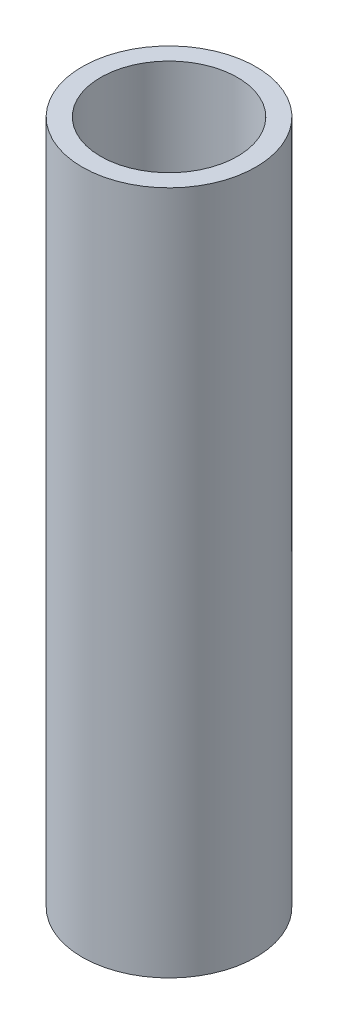
ISO-10303-21;
HEADER;
FILE_DESCRIPTION(('STEP AP214'),'2;1');
FILE_NAME('part.step','',(''),(''),'','','');
FILE_SCHEMA(('AUTOMOTIVE_DESIGN { 1 0 10303 214 1 1 1 1 }'));
ENDSEC;
DATA;
#1=APPLICATION_CONTEXT('core data for automotive mechanical design processes');
#2=APPLICATION_PROTOCOL_DEFINITION('international standard','automotive_design',2000,#1);
#3=PRODUCT_CONTEXT('',#1,'mechanical');
#4=PRODUCT('Part','Part','',(#3));
#5=PRODUCT_RELATED_PRODUCT_CATEGORY('part','',(#4));
#6=PRODUCT_DEFINITION_FORMATION('','',#4);
#7=PRODUCT_DEFINITION_CONTEXT('part definition',#1,'design');
#8=PRODUCT_DEFINITION('design','',#6,#7);
#9=PRODUCT_DEFINITION_SHAPE('','',#8);
#10=(LENGTH_UNIT() NAMED_UNIT(*) SI_UNIT(.MILLI.,.METRE.));
#11=(NAMED_UNIT(*) PLANE_ANGLE_UNIT() SI_UNIT($,.RADIAN.));
#12=(NAMED_UNIT(*) SI_UNIT($,.STERADIAN.) SOLID_ANGLE_UNIT());
#13=UNCERTAINTY_MEASURE_WITH_UNIT(LENGTH_MEASURE(1.E-05),#10,'distance_accuracy_value','');
#14=(GEOMETRIC_REPRESENTATION_CONTEXT(3) GLOBAL_UNCERTAINTY_ASSIGNED_CONTEXT((#13)) GLOBAL_UNIT_ASSIGNED_CONTEXT((#10,
#11,#12)) REPRESENTATION_CONTEXT('',''));
#15=CARTESIAN_POINT('',(0.,0.,0.));
#16=DIRECTION('',(0.,0.,1.));
#17=DIRECTION('',(1.,0.,0.));
#18=AXIS2_PLACEMENT_3D('',#15,#16,#17);
#19=CARTESIAN_POINT('',(0.,50.,0.));
#20=DIRECTION('',(0.,1.,0.));
#21=DIRECTION('',(0.,0.,1.));
#22=AXIS2_PLACEMENT_3D('',#19,#20,#21);
#23=PLANE('',#22);
#24=CARTESIAN_POINT('',(0.,50.,0.));
#25=DIRECTION('',(0.,1.,0.));
#26=DIRECTION('',(0.,0.,1.));
#27=AXIS2_PLACEMENT_3D('',#24,#25,#26);
#28=CIRCLE('',#27,6.35);
#29=CARTESIAN_POINT('',(0.,50.,6.35));
#30=VERTEX_POINT('',#29);
#31=EDGE_CURVE('E10',#30,#30,#28,.T.);
#32=ORIENTED_EDGE('',*,*,#31,.T.);
#33=EDGE_LOOP('',(#32));
#34=FACE_BOUND('',#33,.T.);
#35=CARTESIAN_POINT('',(0.,50.,0.));
#36=DIRECTION('',(0.,1.,0.));
#37=DIRECTION('',(0.,0.,1.));
#38=AXIS2_PLACEMENT_3D('',#35,#36,#37);
#39=CIRCLE('',#38,5.);
#40=CARTESIAN_POINT('',(0.,50.,5.));
#41=VERTEX_POINT('',#40);
#42=EDGE_CURVE('E44',#41,#41,#39,.T.);
#43=ORIENTED_EDGE('',*,*,#42,.F.);
#44=EDGE_LOOP('',(#43));
#45=FACE_BOUND('',#44,.T.);
#46=ADVANCED_FACE('F33',(#34,#45),#23,.T.);
#47=CARTESIAN_POINT('',(0.,0.,0.));
#48=DIRECTION('',(0.,1.,0.));
#49=DIRECTION('',(0.,0.,1.));
#50=AXIS2_PLACEMENT_3D('',#47,#48,#49);
#51=PLANE('',#50);
#52=CARTESIAN_POINT('',(0.,0.,0.));
#53=DIRECTION('',(0.,1.,0.));
#54=DIRECTION('',(0.,0.,1.));
#55=AXIS2_PLACEMENT_3D('',#52,#53,#54);
#56=CIRCLE('',#55,6.35);
#57=CARTESIAN_POINT('',(0.,0.,6.35));
#58=VERTEX_POINT('',#57);
#59=EDGE_CURVE('E37',#58,#58,#56,.T.);
#60=ORIENTED_EDGE('',*,*,#59,.F.);
#61=EDGE_LOOP('',(#60));
#62=FACE_BOUND('',#61,.T.);
#63=CARTESIAN_POINT('',(0.,0.,0.));
#64=DIRECTION('',(0.,1.,0.));
#65=DIRECTION('',(0.,0.,1.));
#66=AXIS2_PLACEMENT_3D('',#63,#64,#65);
#67=CIRCLE('',#66,5.);
#68=CARTESIAN_POINT('',(0.,0.,5.));
#69=VERTEX_POINT('',#68);
#70=EDGE_CURVE('E46',#69,#69,#67,.T.);
#71=ORIENTED_EDGE('',*,*,#70,.T.);
#72=EDGE_LOOP('',(#71));
#73=FACE_BOUND('',#72,.T.);
#74=ADVANCED_FACE('F56',(#62,#73),#51,.F.);
#75=CARTESIAN_POINT('',(0.,50.,0.));
#76=DIRECTION('',(0.,-1.,0.));
#77=DIRECTION('',(0.,0.,-1.));
#78=AXIS2_PLACEMENT_3D('',#75,#76,#77);
#79=CYLINDRICAL_SURFACE('',#78,6.35);
#80=ORIENTED_EDGE('',*,*,#31,.F.);
#81=EDGE_LOOP('',(#80));
#82=FACE_BOUND('',#81,.T.);
#83=ORIENTED_EDGE('',*,*,#59,.T.);
#84=EDGE_LOOP('',(#83));
#85=FACE_BOUND('',#84,.T.);
#86=ADVANCED_FACE('F35',(#82,#85),#79,.T.);
#87=CARTESIAN_POINT('',(0.,50.,0.));
#88=DIRECTION('',(0.,-1.,0.));
#89=DIRECTION('',(0.,0.,-1.));
#90=AXIS2_PLACEMENT_3D('',#87,#88,#89);
#91=CYLINDRICAL_SURFACE('',#90,5.);
#92=ORIENTED_EDGE('',*,*,#42,.T.);
#93=EDGE_LOOP('',(#92));
#94=FACE_BOUND('',#93,.T.);
#95=ORIENTED_EDGE('',*,*,#70,.F.);
#96=EDGE_LOOP('',(#95));
#97=FACE_BOUND('',#96,.T.);
#98=ADVANCED_FACE('F52',(#94,#97),#91,.F.);
#99=CLOSED_SHELL('',(#46,#74,#86,#98));
#100=MANIFOLD_SOLID_BREP('B2',#99);
#101=ADVANCED_BREP_SHAPE_REPRESENTATION('',(#18,#100),#14);
#102=SHAPE_DEFINITION_REPRESENTATION(#9,#101);
ENDSEC;
END-ISO-10303-21;
